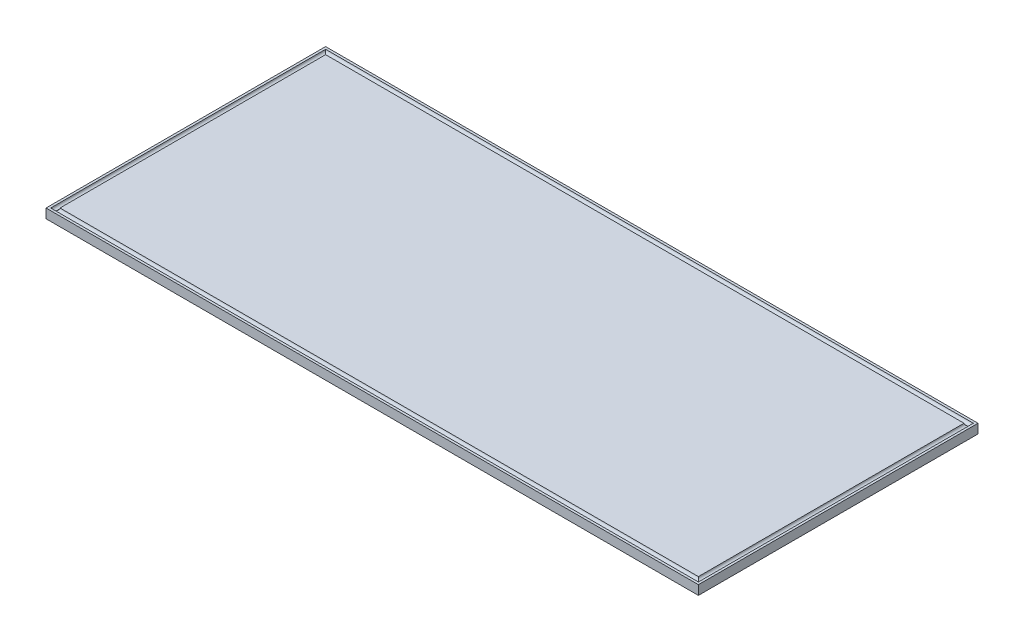
ISO-10303-21;
HEADER;
FILE_DESCRIPTION(('STEP AP214'),'2;1');
FILE_NAME('part.step','',(''),(''),'','','');
FILE_SCHEMA(('AUTOMOTIVE_DESIGN { 1 0 10303 214 1 1 1 1 }'));
ENDSEC;
DATA;
#1=APPLICATION_CONTEXT('core data for automotive mechanical design processes');
#2=APPLICATION_PROTOCOL_DEFINITION('international standard','automotive_design',2000,#1);
#3=PRODUCT_CONTEXT('',#1,'mechanical');
#4=PRODUCT('Part','Part','',(#3));
#5=PRODUCT_RELATED_PRODUCT_CATEGORY('part','',(#4));
#6=PRODUCT_DEFINITION_FORMATION('','',#4);
#7=PRODUCT_DEFINITION_CONTEXT('part definition',#1,'design');
#8=PRODUCT_DEFINITION('design','',#6,#7);
#9=PRODUCT_DEFINITION_SHAPE('','',#8);
#10=(LENGTH_UNIT() NAMED_UNIT(*) SI_UNIT(.MILLI.,.METRE.));
#11=(NAMED_UNIT(*) PLANE_ANGLE_UNIT() SI_UNIT($,.RADIAN.));
#12=(NAMED_UNIT(*) SI_UNIT($,.STERADIAN.) SOLID_ANGLE_UNIT());
#13=UNCERTAINTY_MEASURE_WITH_UNIT(LENGTH_MEASURE(1.E-05),#10,'distance_accuracy_value','');
#14=(GEOMETRIC_REPRESENTATION_CONTEXT(3) GLOBAL_UNCERTAINTY_ASSIGNED_CONTEXT((#13)) GLOBAL_UNIT_ASSIGNED_CONTEXT((#10,
#11,#12)) REPRESENTATION_CONTEXT('',''));
#15=CARTESIAN_POINT('',(0.,0.,0.));
#16=DIRECTION('',(0.,0.,1.));
#17=DIRECTION('',(1.,0.,0.));
#18=AXIS2_PLACEMENT_3D('',#15,#16,#17);
#19=CARTESIAN_POINT('',(0.,2.,0.));
#20=DIRECTION('',(0.,-1.,0.));
#21=DIRECTION('',(0.,0.,-1.));
#22=AXIS2_PLACEMENT_3D('',#19,#20,#21);
#23=PLANE('',#22);
#24=DIRECTION('',(0.,0.,1.));
#25=VECTOR('',#24,1.);
#26=CARTESIAN_POINT('',(-0.499999999999999,2.,0.349999999999989));
#27=LINE('',#26,#25);
#28=CARTESIAN_POINT('',(-0.5,2.,0.5));
#29=VERTEX_POINT('',#28);
#30=CARTESIAN_POINT('',(-0.499999999999999,2.,59.5));
#31=VERTEX_POINT('',#30);
#32=EDGE_CURVE('E120',#29,#31,#27,.T.);
#33=ORIENTED_EDGE('',*,*,#32,.T.);
#34=DIRECTION('',(-1.,0.,0.));
#35=VECTOR('',#34,1.);
#36=CARTESIAN_POINT('',(-0.349999999999989,2.,59.5));
#37=LINE('',#36,#35);
#38=CARTESIAN_POINT('',(-139.5,2.,59.5));
#39=VERTEX_POINT('',#38);
#40=EDGE_CURVE('E12',#31,#39,#37,.T.);
#41=ORIENTED_EDGE('',*,*,#40,.T.);
#42=DIRECTION('',(0.,0.,-1.));
#43=VECTOR('',#42,1.);
#44=CARTESIAN_POINT('',(-139.5,2.,59.6500000000001));
#45=LINE('',#44,#43);
#46=CARTESIAN_POINT('',(-139.5,2.,0.500000000000017));
#47=VERTEX_POINT('',#46);
#48=EDGE_CURVE('E60',#39,#47,#45,.T.);
#49=ORIENTED_EDGE('',*,*,#48,.T.);
#50=DIRECTION('',(1.,0.,0.));
#51=VECTOR('',#50,1.);
#52=CARTESIAN_POINT('',(-139.65,2.,0.500000000000017));
#53=LINE('',#52,#51);
#54=EDGE_CURVE('E114',#47,#29,#53,.T.);
#55=ORIENTED_EDGE('',*,*,#54,.T.);
#56=EDGE_LOOP('',(#33,#41,#49,#55));
#57=FACE_BOUND('',#56,.T.);
#58=DIRECTION('',(0.,0.,-1.));
#59=VECTOR('',#58,1.);
#60=CARTESIAN_POINT('',(0.,2.,0.));
#61=LINE('',#60,#59);
#62=CARTESIAN_POINT('',(0.,2.,60.));
#63=VERTEX_POINT('',#62);
#64=CARTESIAN_POINT('',(0.,2.,0.));
#65=VERTEX_POINT('',#64);
#66=EDGE_CURVE('E170',#63,#65,#61,.T.);
#67=ORIENTED_EDGE('',*,*,#66,.T.);
#68=DIRECTION('',(-1.,0.,0.));
#69=VECTOR('',#68,1.);
#70=CARTESIAN_POINT('',(0.,2.,0.));
#71=LINE('',#70,#69);
#72=CARTESIAN_POINT('',(-140.,2.,0.));
#73=VERTEX_POINT('',#72);
#74=EDGE_CURVE('E186',#65,#73,#71,.T.);
#75=ORIENTED_EDGE('',*,*,#74,.T.);
#76=DIRECTION('',(0.,0.,1.));
#77=VECTOR('',#76,1.);
#78=CARTESIAN_POINT('',(-140.,2.,0.));
#79=LINE('',#78,#77);
#80=CARTESIAN_POINT('',(-140.,2.,60.));
#81=VERTEX_POINT('',#80);
#82=EDGE_CURVE('E183',#73,#81,#79,.T.);
#83=ORIENTED_EDGE('',*,*,#82,.T.);
#84=DIRECTION('',(1.,0.,0.));
#85=VECTOR('',#84,1.);
#86=CARTESIAN_POINT('',(0.,2.,60.));
#87=LINE('',#86,#85);
#88=EDGE_CURVE('E166',#81,#63,#87,.T.);
#89=ORIENTED_EDGE('',*,*,#88,.T.);
#90=EDGE_LOOP('',(#67,#75,#83,#89));
#91=FACE_BOUND('',#90,.T.);
#92=ADVANCED_FACE('F51',(#57,#91),#23,.F.);
#93=CARTESIAN_POINT('',(0.,2.,0.));
#94=DIRECTION('',(-1.,0.,0.));
#95=DIRECTION('',(0.,0.,1.));
#96=AXIS2_PLACEMENT_3D('',#93,#94,#95);
#97=PLANE('',#96);
#98=DIRECTION('',(0.,0.,-1.));
#99=VECTOR('',#98,1.);
#100=CARTESIAN_POINT('',(0.,0.,0.));
#101=LINE('',#100,#99);
#102=CARTESIAN_POINT('',(0.,0.,60.));
#103=VERTEX_POINT('',#102);
#104=CARTESIAN_POINT('',(0.,0.,0.));
#105=VERTEX_POINT('',#104);
#106=EDGE_CURVE('E177',#103,#105,#101,.T.);
#107=ORIENTED_EDGE('',*,*,#106,.T.);
#108=DIRECTION('',(0.,-1.,0.));
#109=VECTOR('',#108,1.);
#110=CARTESIAN_POINT('',(0.,2.,0.));
#111=LINE('',#110,#109);
#112=EDGE_CURVE('E150',#65,#105,#111,.T.);
#113=ORIENTED_EDGE('',*,*,#112,.F.);
#114=ORIENTED_EDGE('',*,*,#66,.F.);
#115=DIRECTION('',(0.,-1.,0.));
#116=VECTOR('',#115,1.);
#117=CARTESIAN_POINT('',(0.,2.,60.));
#118=LINE('',#117,#116);
#119=EDGE_CURVE('E162',#63,#103,#118,.T.);
#120=ORIENTED_EDGE('',*,*,#119,.T.);
#121=EDGE_LOOP('',(#107,#113,#114,#120));
#122=FACE_BOUND('',#121,.T.);
#123=ADVANCED_FACE('F53',(#122),#97,.F.);
#124=CARTESIAN_POINT('',(0.,2.,0.));
#125=DIRECTION('',(0.,0.,1.));
#126=DIRECTION('',(1.,0.,0.));
#127=AXIS2_PLACEMENT_3D('',#124,#125,#126);
#128=PLANE('',#127);
#129=DIRECTION('',(-1.,0.,0.));
#130=VECTOR('',#129,1.);
#131=CARTESIAN_POINT('',(0.,0.,0.));
#132=LINE('',#131,#130);
#133=CARTESIAN_POINT('',(-140.,0.,0.));
#134=VERTEX_POINT('',#133);
#135=EDGE_CURVE('E174',#105,#134,#132,.T.);
#136=ORIENTED_EDGE('',*,*,#135,.T.);
#137=DIRECTION('',(0.,-1.,0.));
#138=VECTOR('',#137,1.);
#139=CARTESIAN_POINT('',(-140.,2.,0.));
#140=LINE('',#139,#138);
#141=EDGE_CURVE('E154',#73,#134,#140,.T.);
#142=ORIENTED_EDGE('',*,*,#141,.F.);
#143=ORIENTED_EDGE('',*,*,#74,.F.);
#144=ORIENTED_EDGE('',*,*,#112,.T.);
#145=EDGE_LOOP('',(#136,#142,#143,#144));
#146=FACE_BOUND('',#145,.T.);
#147=ADVANCED_FACE('F222',(#146),#128,.F.);
#148=CARTESIAN_POINT('',(-140.,2.,0.));
#149=DIRECTION('',(1.,0.,0.));
#150=DIRECTION('',(0.,0.,-1.));
#151=AXIS2_PLACEMENT_3D('',#148,#149,#150);
#152=PLANE('',#151);
#153=DIRECTION('',(0.,0.,1.));
#154=VECTOR('',#153,1.);
#155=CARTESIAN_POINT('',(-140.,0.,0.));
#156=LINE('',#155,#154);
#157=CARTESIAN_POINT('',(-140.,0.,60.));
#158=VERTEX_POINT('',#157);
#159=EDGE_CURVE('E171',#134,#158,#156,.T.);
#160=ORIENTED_EDGE('',*,*,#159,.T.);
#161=DIRECTION('',(0.,-1.,0.));
#162=VECTOR('',#161,1.);
#163=CARTESIAN_POINT('',(-140.,2.,60.));
#164=LINE('',#163,#162);
#165=EDGE_CURVE('E158',#81,#158,#164,.T.);
#166=ORIENTED_EDGE('',*,*,#165,.F.);
#167=ORIENTED_EDGE('',*,*,#82,.F.);
#168=ORIENTED_EDGE('',*,*,#141,.T.);
#169=EDGE_LOOP('',(#160,#166,#167,#168));
#170=FACE_BOUND('',#169,.T.);
#171=ADVANCED_FACE('F263',(#170),#152,.F.);
#172=CARTESIAN_POINT('',(0.,2.,60.));
#173=DIRECTION('',(0.,0.,-1.));
#174=DIRECTION('',(-1.,0.,0.));
#175=AXIS2_PLACEMENT_3D('',#172,#173,#174);
#176=PLANE('',#175);
#177=DIRECTION('',(1.,0.,0.));
#178=VECTOR('',#177,1.);
#179=CARTESIAN_POINT('',(0.,0.,60.));
#180=LINE('',#179,#178);
#181=EDGE_CURVE('E167',#158,#103,#180,.T.);
#182=ORIENTED_EDGE('',*,*,#181,.T.);
#183=ORIENTED_EDGE('',*,*,#119,.F.);
#184=ORIENTED_EDGE('',*,*,#88,.F.);
#185=ORIENTED_EDGE('',*,*,#165,.T.);
#186=EDGE_LOOP('',(#182,#183,#184,#185));
#187=FACE_BOUND('',#186,.T.);
#188=ADVANCED_FACE('F214',(#187),#176,.F.);
#189=CARTESIAN_POINT('',(0.,0.,0.));
#190=DIRECTION('',(0.,-1.,0.));
#191=DIRECTION('',(0.,0.,-1.));
#192=AXIS2_PLACEMENT_3D('',#189,#190,#191);
#193=PLANE('',#192);
#194=ORIENTED_EDGE('',*,*,#106,.F.);
#195=ORIENTED_EDGE('',*,*,#181,.F.);
#196=ORIENTED_EDGE('',*,*,#159,.F.);
#197=ORIENTED_EDGE('',*,*,#135,.F.);
#198=EDGE_LOOP('',(#194,#195,#196,#197));
#199=FACE_BOUND('',#198,.T.);
#200=ADVANCED_FACE('F207',(#199),#193,.T.);
#201=CARTESIAN_POINT('',(-0.349999999999989,2.,59.));
#202=DIRECTION('',(-1.,0.,0.));
#203=DIRECTION('',(0.,0.,1.));
#204=AXIS2_PLACEMENT_3D('',#201,#202,#203);
#205=CYLINDRICAL_SURFACE('',#204,0.5);
#206=CARTESIAN_POINT('',(-0.999999999999999,2.,59.));
#207=DIRECTION('',(-0.707106781186547,0.,0.707106781186548));
#208=DIRECTION('',(0.707106781186548,0.,0.707106781186547));
#209=AXIS2_PLACEMENT_3D('',#206,#207,#208);
#210=ELLIPSE('',#209,0.707106781186547,0.5);
#211=CARTESIAN_POINT('',(-1.5,2.,58.5));
#212=VERTEX_POINT('',#211);
#213=EDGE_CURVE('E131',#31,#212,#210,.F.);
#214=ORIENTED_EDGE('',*,*,#213,.T.);
#215=DIRECTION('',(-1.,0.,0.));
#216=VECTOR('',#215,1.);
#217=CARTESIAN_POINT('',(-0.349999999999989,2.,58.5));
#218=LINE('',#217,#216);
#219=CARTESIAN_POINT('',(-138.5,2.,58.5));
#220=VERTEX_POINT('',#219);
#221=EDGE_CURVE('E121',#220,#212,#218,.F.);
#222=ORIENTED_EDGE('',*,*,#221,.F.);
#223=CARTESIAN_POINT('',(-139.,2.,59.));
#224=DIRECTION('',(-0.707106781186548,0.,-0.707106781186547));
#225=DIRECTION('',(0.707106781186547,0.,-0.707106781186548));
#226=AXIS2_PLACEMENT_3D('',#223,#224,#225);
#227=ELLIPSE('',#226,0.707106781186548,0.5);
#228=EDGE_CURVE('E192',#39,#220,#227,.F.);
#229=ORIENTED_EDGE('',*,*,#228,.F.);
#230=ORIENTED_EDGE('',*,*,#40,.F.);
#231=EDGE_LOOP('',(#214,#222,#229,#230));
#232=FACE_BOUND('',#231,.T.);
#233=ADVANCED_FACE('F205',(#232),#205,.F.);
#234=CARTESIAN_POINT('',(-139.,2.,59.6500000000001));
#235=DIRECTION('',(0.,0.,-1.));
#236=DIRECTION('',(-1.,0.,0.));
#237=AXIS2_PLACEMENT_3D('',#234,#235,#236);
#238=CYLINDRICAL_SURFACE('',#237,0.5);
#239=ORIENTED_EDGE('',*,*,#228,.T.);
#240=DIRECTION('',(0.,0.,-1.));
#241=VECTOR('',#240,1.);
#242=CARTESIAN_POINT('',(-138.5,2.,59.6500000000001));
#243=LINE('',#242,#241);
#244=CARTESIAN_POINT('',(-138.5,2.,1.50000000000002));
#245=VERTEX_POINT('',#244);
#246=EDGE_CURVE('E128',#245,#220,#243,.F.);
#247=ORIENTED_EDGE('',*,*,#246,.F.);
#248=CARTESIAN_POINT('',(-139.,2.,1.00000000000002));
#249=DIRECTION('',(0.707106781186547,0.,-0.707106781186547));
#250=DIRECTION('',(0.707106781186548,0.,0.707106781186548));
#251=AXIS2_PLACEMENT_3D('',#248,#249,#250);
#252=ELLIPSE('',#251,0.707106781186547,0.5);
#253=EDGE_CURVE('E72',#47,#245,#252,.F.);
#254=ORIENTED_EDGE('',*,*,#253,.F.);
#255=ORIENTED_EDGE('',*,*,#48,.F.);
#256=EDGE_LOOP('',(#239,#247,#254,#255));
#257=FACE_BOUND('',#256,.T.);
#258=ADVANCED_FACE('F125',(#257),#238,.F.);
#259=CARTESIAN_POINT('',(-0.999999999999999,2.,0.349999999999989));
#260=DIRECTION('',(0.,0.,1.));
#261=DIRECTION('',(1.,0.,0.));
#262=AXIS2_PLACEMENT_3D('',#259,#260,#261);
#263=CYLINDRICAL_SURFACE('',#262,0.5);
#264=CARTESIAN_POINT('',(-1.,2.,1.));
#265=DIRECTION('',(0.707106781186547,0.,0.707106781186547));
#266=DIRECTION('',(0.707106781186548,0.,-0.707106781186548));
#267=AXIS2_PLACEMENT_3D('',#264,#265,#266);
#268=ELLIPSE('',#267,0.707106781186548,0.5);
#269=CARTESIAN_POINT('',(-1.5,2.,1.5));
#270=VERTEX_POINT('',#269);
#271=EDGE_CURVE('E67',#29,#270,#268,.F.);
#272=ORIENTED_EDGE('',*,*,#271,.T.);
#273=DIRECTION('',(0.,0.,1.));
#274=VECTOR('',#273,1.);
#275=CARTESIAN_POINT('',(-1.5,2.,0.349999999999989));
#276=LINE('',#275,#274);
#277=EDGE_CURVE('E143',#212,#270,#276,.F.);
#278=ORIENTED_EDGE('',*,*,#277,.F.);
#279=ORIENTED_EDGE('',*,*,#213,.F.);
#280=ORIENTED_EDGE('',*,*,#32,.F.);
#281=EDGE_LOOP('',(#272,#278,#279,#280));
#282=FACE_BOUND('',#281,.T.);
#283=ADVANCED_FACE('F200',(#282),#263,.F.);
#284=CARTESIAN_POINT('',(-139.65,2.,1.00000000000002));
#285=DIRECTION('',(1.,0.,0.));
#286=DIRECTION('',(0.,0.,-1.));
#287=AXIS2_PLACEMENT_3D('',#284,#285,#286);
#288=CYLINDRICAL_SURFACE('',#287,0.5);
#289=ORIENTED_EDGE('',*,*,#253,.T.);
#290=DIRECTION('',(1.,0.,0.));
#291=VECTOR('',#290,1.);
#292=CARTESIAN_POINT('',(-139.65,2.,1.50000000000002));
#293=LINE('',#292,#291);
#294=EDGE_CURVE('E147',#270,#245,#293,.F.);
#295=ORIENTED_EDGE('',*,*,#294,.F.);
#296=ORIENTED_EDGE('',*,*,#271,.F.);
#297=ORIENTED_EDGE('',*,*,#54,.F.);
#298=EDGE_LOOP('',(#289,#295,#296,#297));
#299=FACE_BOUND('',#298,.T.);
#300=ADVANCED_FACE('F115',(#299),#288,.F.);
#301=ORIENTED_EDGE('',*,*,#246,.T.);
#302=ORIENTED_EDGE('',*,*,#221,.T.);
#303=ORIENTED_EDGE('',*,*,#277,.T.);
#304=ORIENTED_EDGE('',*,*,#294,.T.);
#305=EDGE_LOOP('',(#301,#302,#303,#304));
#306=FACE_BOUND('',#305,.T.);
#307=ADVANCED_FACE('F203',(#306),#23,.F.);
#308=CLOSED_SHELL('',(#92,#123,#147,#171,#188,#200,#233,#258,#283,#300,#307));
#309=MANIFOLD_SOLID_BREP('B2',#308);
#310=ADVANCED_BREP_SHAPE_REPRESENTATION('',(#18,#309),#14);
#311=SHAPE_DEFINITION_REPRESENTATION(#9,#310);
ENDSEC;
END-ISO-10303-21;
